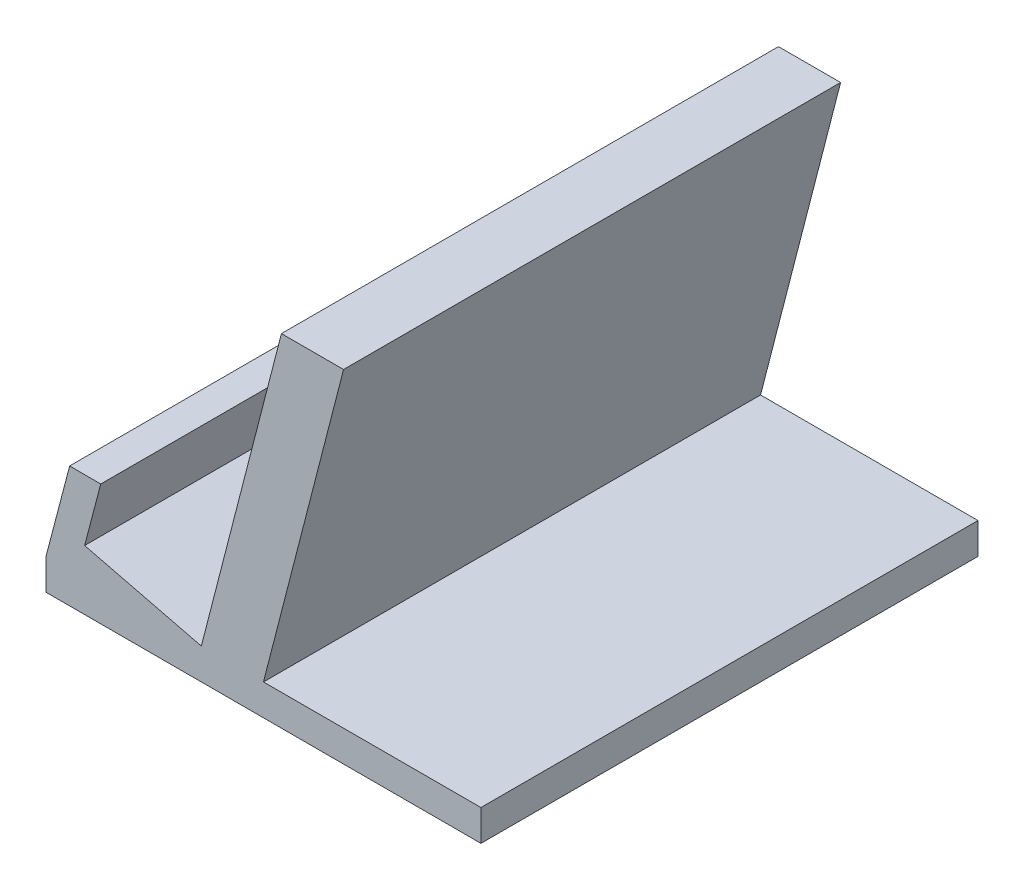
ISO-10303-21;
HEADER;
FILE_DESCRIPTION(('STEP AP214'),'2;1');
FILE_NAME('part.step','',(''),(''),'','','');
FILE_SCHEMA(('AUTOMOTIVE_DESIGN { 1 0 10303 214 1 1 1 1 }'));
ENDSEC;
DATA;
#1=APPLICATION_CONTEXT('core data for automotive mechanical design processes');
#2=APPLICATION_PROTOCOL_DEFINITION('international standard','automotive_design',2000,#1);
#3=PRODUCT_CONTEXT('',#1,'mechanical');
#4=PRODUCT('Part','Part','',(#3));
#5=PRODUCT_RELATED_PRODUCT_CATEGORY('part','',(#4));
#6=PRODUCT_DEFINITION_FORMATION('','',#4);
#7=PRODUCT_DEFINITION_CONTEXT('part definition',#1,'design');
#8=PRODUCT_DEFINITION('design','',#6,#7);
#9=PRODUCT_DEFINITION_SHAPE('','',#8);
#10=(LENGTH_UNIT() NAMED_UNIT(*) SI_UNIT(.MILLI.,.METRE.));
#11=(NAMED_UNIT(*) PLANE_ANGLE_UNIT() SI_UNIT($,.RADIAN.));
#12=(NAMED_UNIT(*) SI_UNIT($,.STERADIAN.) SOLID_ANGLE_UNIT());
#13=UNCERTAINTY_MEASURE_WITH_UNIT(LENGTH_MEASURE(1.E-05),#10,'distance_accuracy_value','');
#14=(GEOMETRIC_REPRESENTATION_CONTEXT(3) GLOBAL_UNCERTAINTY_ASSIGNED_CONTEXT((#13)) GLOBAL_UNIT_ASSIGNED_CONTEXT((#10,
#11,#12)) REPRESENTATION_CONTEXT('',''));
#15=CARTESIAN_POINT('',(0.,0.,0.));
#16=DIRECTION('',(0.,0.,1.));
#17=DIRECTION('',(1.,0.,0.));
#18=AXIS2_PLACEMENT_3D('',#15,#16,#17);
#19=CARTESIAN_POINT('',(-28.0411236469754,7.35367463730965,80.));
#20=DIRECTION('',(0.967291256656847,-0.253668336209348,0.));
#21=DIRECTION('',(0.253668336209348,0.967291256656847,0.));
#22=AXIS2_PLACEMENT_3D('',#19,#20,#21);
#23=PLANE('',#22);
#24=DIRECTION('',(-0.253668336209348,-0.967291256656847,0.));
#25=VECTOR('',#24,1.);
#26=CARTESIAN_POINT('',(-28.0411236469754,7.35367463730965,0.));
#27=LINE('',#26,#25);
#28=CARTESIAN_POINT('',(-26.2396966085866,14.222898639712,0.));
#29=VERTEX_POINT('',#28);
#30=CARTESIAN_POINT('',(-28.8273988234463,4.35544034882152,0.));
#31=VERTEX_POINT('',#30);
#32=EDGE_CURVE('E157',#29,#31,#27,.T.);
#33=ORIENTED_EDGE('',*,*,#32,.F.);
#34=DIRECTION('',(0.,0.,-1.));
#35=VECTOR('',#34,1.);
#36=CARTESIAN_POINT('',(-26.2396966085866,14.222898639712,80.));
#37=LINE('',#36,#35);
#38=CARTESIAN_POINT('',(-26.2396966085866,14.222898639712,80.));
#39=VERTEX_POINT('',#38);
#40=EDGE_CURVE('E11',#39,#29,#37,.T.);
#41=ORIENTED_EDGE('',*,*,#40,.F.);
#42=DIRECTION('',(-0.253668336209348,-0.967291256656847,0.));
#43=VECTOR('',#42,1.);
#44=CARTESIAN_POINT('',(-28.0411236469754,7.35367463730965,80.));
#45=LINE('',#44,#43);
#46=CARTESIAN_POINT('',(-28.8273988234463,4.35544034882152,80.));
#47=VERTEX_POINT('',#46);
#48=EDGE_CURVE('E196',#39,#47,#45,.T.);
#49=ORIENTED_EDGE('',*,*,#48,.T.);
#50=DIRECTION('',(0.,0.,-1.));
#51=VECTOR('',#50,1.);
#52=CARTESIAN_POINT('',(-28.8273988234463,4.35544034882152,80.));
#53=LINE('',#52,#51);
#54=EDGE_CURVE('E101',#47,#31,#53,.T.);
#55=ORIENTED_EDGE('',*,*,#54,.T.);
#56=EDGE_LOOP('',(#33,#41,#49,#55));
#57=FACE_BOUND('',#56,.T.);
#58=ADVANCED_FACE('F41',(#57),#23,.T.);
#59=CARTESIAN_POINT('',(0.0520578395815223,14.1260070032385,80.));
#60=DIRECTION('',(0.00368522301263524,0.999993209542618,0.));
#61=DIRECTION('',(-0.999993209542618,0.00368522301263524,0.));
#62=AXIS2_PLACEMENT_3D('',#59,#60,#61);
#63=PLANE('',#62);
#64=DIRECTION('',(0.999993209542618,-0.00368522301263524,0.));
#65=VECTOR('',#64,1.);
#66=CARTESIAN_POINT('',(0.0520578395815223,14.1260070032385,0.));
#67=LINE('',#66,#65);
#68=CARTESIAN_POINT('',(-31.2396626562997,14.2413247547752,0.));
#69=VERTEX_POINT('',#68);
#70=EDGE_CURVE('E161',#69,#29,#67,.T.);
#71=ORIENTED_EDGE('',*,*,#70,.F.);
#72=DIRECTION('',(0.,0.,-1.));
#73=VECTOR('',#72,1.);
#74=CARTESIAN_POINT('',(-31.2396626562997,14.2413247547752,80.));
#75=LINE('',#74,#73);
#76=CARTESIAN_POINT('',(-31.2396626562997,14.2413247547752,80.));
#77=VERTEX_POINT('',#76);
#78=EDGE_CURVE('E50',#77,#69,#75,.T.);
#79=ORIENTED_EDGE('',*,*,#78,.F.);
#80=DIRECTION('',(0.999993209542618,-0.00368522301263524,0.));
#81=VECTOR('',#80,1.);
#82=CARTESIAN_POINT('',(0.0520578395815223,14.1260070032385,80.));
#83=LINE('',#82,#81);
#84=EDGE_CURVE('E241',#77,#39,#83,.T.);
#85=ORIENTED_EDGE('',*,*,#84,.T.);
#86=ORIENTED_EDGE('',*,*,#40,.T.);
#87=EDGE_LOOP('',(#71,#79,#85,#86));
#88=FACE_BOUND('',#87,.T.);
#89=ADVANCED_FACE('F229',(#88),#63,.T.);
#90=CARTESIAN_POINT('',(-32.723874992757,8.58170780166598,80.));
#91=DIRECTION('',(-0.967291256656847,0.253668336209347,0.));
#92=DIRECTION('',(-0.253668336209347,-0.967291256656847,0.));
#93=AXIS2_PLACEMENT_3D('',#90,#91,#92);
#94=PLANE('',#93);
#95=DIRECTION('',(0.253668336209347,0.967291256656847,0.));
#96=VECTOR('',#95,1.);
#97=CARTESIAN_POINT('',(-32.723874992757,8.58170780166598,0.));
#98=LINE('',#97,#96);
#99=CARTESIAN_POINT('',(-35.0454432360245,-0.270925116584983,0.));
#100=VERTEX_POINT('',#99);
#101=EDGE_CURVE('E165',#100,#69,#98,.T.);
#102=ORIENTED_EDGE('',*,*,#101,.F.);
#103=DIRECTION('',(0.,0.,-1.));
#104=VECTOR('',#103,1.);
#105=CARTESIAN_POINT('',(-35.0454432360245,-0.270925116584983,80.));
#106=LINE('',#105,#104);
#107=CARTESIAN_POINT('',(-35.0454432360245,-0.270925116584983,80.));
#108=VERTEX_POINT('',#107);
#109=EDGE_CURVE('E216',#108,#100,#106,.T.);
#110=ORIENTED_EDGE('',*,*,#109,.F.);
#111=DIRECTION('',(0.253668336209347,0.967291256656847,0.));
#112=VECTOR('',#111,1.);
#113=CARTESIAN_POINT('',(-32.723874992757,8.58170780166598,80.));
#114=LINE('',#113,#112);
#115=EDGE_CURVE('E225',#108,#77,#114,.T.);
#116=ORIENTED_EDGE('',*,*,#115,.T.);
#117=ORIENTED_EDGE('',*,*,#78,.T.);
#118=EDGE_LOOP('',(#102,#110,#116,#117));
#119=FACE_BOUND('',#118,.T.);
#120=ADVANCED_FACE('F223',(#119),#94,.T.);
#121=CARTESIAN_POINT('',(-35.0454432360245,0.,80.));
#122=DIRECTION('',(-1.,0.,0.));
#123=DIRECTION('',(0.,0.,1.));
#124=AXIS2_PLACEMENT_3D('',#121,#122,#123);
#125=PLANE('',#124);
#126=DIRECTION('',(0.,1.,0.));
#127=VECTOR('',#126,1.);
#128=CARTESIAN_POINT('',(-35.0454432360245,0.,0.));
#129=LINE('',#128,#127);
#130=CARTESIAN_POINT('',(-35.0454432360245,-5.27092511658498,0.));
#131=VERTEX_POINT('',#130);
#132=EDGE_CURVE('E169',#131,#100,#129,.T.);
#133=ORIENTED_EDGE('',*,*,#132,.F.);
#134=DIRECTION('',(0.,0.,-1.));
#135=VECTOR('',#134,1.);
#136=CARTESIAN_POINT('',(-35.0454432360245,-5.27092511658498,80.));
#137=LINE('',#136,#135);
#138=CARTESIAN_POINT('',(-35.0454432360245,-5.27092511658498,80.));
#139=VERTEX_POINT('',#138);
#140=EDGE_CURVE('E213',#139,#131,#137,.T.);
#141=ORIENTED_EDGE('',*,*,#140,.F.);
#142=DIRECTION('',(0.,1.,0.));
#143=VECTOR('',#142,1.);
#144=CARTESIAN_POINT('',(-35.0454432360245,0.,80.));
#145=LINE('',#144,#143);
#146=EDGE_CURVE('E240',#139,#108,#145,.T.);
#147=ORIENTED_EDGE('',*,*,#146,.T.);
#148=ORIENTED_EDGE('',*,*,#109,.T.);
#149=EDGE_LOOP('',(#133,#141,#147,#148));
#150=FACE_BOUND('',#149,.T.);
#151=ADVANCED_FACE('F236',(#150),#125,.T.);
#152=CARTESIAN_POINT('',(0.,-5.27092511658498,80.));
#153=DIRECTION('',(0.,1.,0.));
#154=DIRECTION('',(0.,0.,1.));
#155=AXIS2_PLACEMENT_3D('',#152,#153,#154);
#156=PLANE('',#155);
#157=DIRECTION('',(1.,0.,0.));
#158=VECTOR('',#157,1.);
#159=CARTESIAN_POINT('',(0.,-5.27092511658498,0.));
#160=LINE('',#159,#158);
#161=CARTESIAN_POINT('',(34.9545567639755,-5.27092511658498,0.));
#162=VERTEX_POINT('',#161);
#163=EDGE_CURVE('E173',#131,#162,#160,.T.);
#164=ORIENTED_EDGE('',*,*,#163,.T.);
#165=DIRECTION('',(0.,0.,-1.));
#166=VECTOR('',#165,1.);
#167=CARTESIAN_POINT('',(34.9545567639755,-5.27092511658498,80.));
#168=LINE('',#167,#166);
#169=CARTESIAN_POINT('',(34.9545567639755,-5.27092511658498,80.));
#170=VERTEX_POINT('',#169);
#171=EDGE_CURVE('E209',#170,#162,#168,.T.);
#172=ORIENTED_EDGE('',*,*,#171,.F.);
#173=DIRECTION('',(1.,0.,0.));
#174=VECTOR('',#173,1.);
#175=CARTESIAN_POINT('',(0.,-5.27092511658498,80.));
#176=LINE('',#175,#174);
#177=EDGE_CURVE('E246',#139,#170,#176,.T.);
#178=ORIENTED_EDGE('',*,*,#177,.F.);
#179=ORIENTED_EDGE('',*,*,#140,.T.);
#180=EDGE_LOOP('',(#164,#172,#178,#179));
#181=FACE_BOUND('',#180,.T.);
#182=ADVANCED_FACE('F340',(#181),#156,.F.);
#183=CARTESIAN_POINT('',(34.9545567639755,0.,80.));
#184=DIRECTION('',(-1.,0.,0.));
#185=DIRECTION('',(0.,0.,1.));
#186=AXIS2_PLACEMENT_3D('',#183,#184,#185);
#187=PLANE('',#186);
#188=DIRECTION('',(0.,1.,0.));
#189=VECTOR('',#188,1.);
#190=CARTESIAN_POINT('',(34.9545567639755,0.,0.));
#191=LINE('',#190,#189);
#192=CARTESIAN_POINT('',(34.9545567639755,-0.270925116584983,0.));
#193=VERTEX_POINT('',#192);
#194=EDGE_CURVE('E176',#162,#193,#191,.T.);
#195=ORIENTED_EDGE('',*,*,#194,.T.);
#196=DIRECTION('',(0.,0.,-1.));
#197=VECTOR('',#196,1.);
#198=CARTESIAN_POINT('',(34.9545567639755,-0.270925116584983,80.));
#199=LINE('',#198,#197);
#200=CARTESIAN_POINT('',(34.9545567639755,-0.270925116584983,80.));
#201=VERTEX_POINT('',#200);
#202=EDGE_CURVE('E206',#201,#193,#199,.T.);
#203=ORIENTED_EDGE('',*,*,#202,.F.);
#204=DIRECTION('',(0.,1.,0.));
#205=VECTOR('',#204,1.);
#206=CARTESIAN_POINT('',(34.9545567639755,0.,80.));
#207=LINE('',#206,#205);
#208=EDGE_CURVE('E253',#170,#201,#207,.T.);
#209=ORIENTED_EDGE('',*,*,#208,.F.);
#210=ORIENTED_EDGE('',*,*,#171,.T.);
#211=EDGE_LOOP('',(#195,#203,#209,#210));
#212=FACE_BOUND('',#211,.T.);
#213=ADVANCED_FACE('F267',(#212),#187,.F.);
#214=CARTESIAN_POINT('',(0.,-0.270925116584983,80.));
#215=DIRECTION('',(0.,1.,0.));
#216=DIRECTION('',(0.,0.,1.));
#217=AXIS2_PLACEMENT_3D('',#214,#215,#216);
#218=PLANE('',#217);
#219=DIRECTION('',(1.,0.,0.));
#220=VECTOR('',#219,1.);
#221=CARTESIAN_POINT('',(0.,-0.270925116584983,0.));
#222=LINE('',#221,#220);
#223=CARTESIAN_POINT('',(-0.0454432360245064,-0.270925116584983,0.));
#224=VERTEX_POINT('',#223);
#225=EDGE_CURVE('E180',#224,#193,#222,.T.);
#226=ORIENTED_EDGE('',*,*,#225,.F.);
#227=DIRECTION('',(0.,0.,-1.));
#228=VECTOR('',#227,1.);
#229=CARTESIAN_POINT('',(-0.0454432360245064,-0.270925116584983,80.));
#230=LINE('',#229,#228);
#231=CARTESIAN_POINT('',(-0.0454432360245064,-0.270925116584983,80.));
#232=VERTEX_POINT('',#231);
#233=EDGE_CURVE('E203',#232,#224,#230,.T.);
#234=ORIENTED_EDGE('',*,*,#233,.F.);
#235=DIRECTION('',(1.,0.,0.));
#236=VECTOR('',#235,1.);
#237=CARTESIAN_POINT('',(0.,-0.270925116584983,80.));
#238=LINE('',#237,#236);
#239=EDGE_CURVE('E256',#232,#201,#238,.T.);
#240=ORIENTED_EDGE('',*,*,#239,.T.);
#241=ORIENTED_EDGE('',*,*,#202,.T.);
#242=EDGE_LOOP('',(#226,#234,#240,#241));
#243=FACE_BOUND('',#242,.T.);
#244=ADVANCED_FACE('F262',(#243),#218,.T.);
#245=CARTESIAN_POINT('',(0.0228768255995616,-0.00589729070730279,80.));
#246=DIRECTION('',(-0.968342899297644,0.249623775670173,0.));
#247=DIRECTION('',(-0.249623775670173,-0.968342899297644,0.));
#248=AXIS2_PLACEMENT_3D('',#245,#246,#247);
#249=PLANE('',#248);
#250=DIRECTION('',(0.249623775670173,0.968342899297644,0.));
#251=VECTOR('',#250,1.);
#252=CARTESIAN_POINT('',(0.0228768255995616,-0.00589729070730279,0.));
#253=LINE('',#252,#251);
#254=CARTESIAN_POINT('',(12.8437810176582,49.729074883415,0.));
#255=VERTEX_POINT('',#254);
#256=EDGE_CURVE('E184',#224,#255,#253,.T.);
#257=ORIENTED_EDGE('',*,*,#256,.T.);
#258=DIRECTION('',(0.,0.,-1.));
#259=VECTOR('',#258,1.);
#260=CARTESIAN_POINT('',(12.8437810176582,49.729074883415,80.));
#261=LINE('',#260,#259);
#262=CARTESIAN_POINT('',(12.8437810176582,49.729074883415,80.));
#263=VERTEX_POINT('',#262);
#264=EDGE_CURVE('E140',#263,#255,#261,.T.);
#265=ORIENTED_EDGE('',*,*,#264,.F.);
#266=DIRECTION('',(0.249623775670173,0.968342899297644,0.));
#267=VECTOR('',#266,1.);
#268=CARTESIAN_POINT('',(0.0228768255995616,-0.00589729070730279,80.));
#269=LINE('',#268,#267);
#270=EDGE_CURVE('E146',#232,#263,#269,.T.);
#271=ORIENTED_EDGE('',*,*,#270,.F.);
#272=ORIENTED_EDGE('',*,*,#233,.T.);
#273=EDGE_LOOP('',(#257,#265,#271,#272));
#274=FACE_BOUND('',#273,.T.);
#275=ADVANCED_FACE('F270',(#274),#249,.F.);
#276=CARTESIAN_POINT('',(0.,49.729074883415,80.));
#277=DIRECTION('',(0.,1.,0.));
#278=DIRECTION('',(0.,0.,1.));
#279=AXIS2_PLACEMENT_3D('',#276,#277,#278);
#280=PLANE('',#279);
#281=DIRECTION('',(1.,0.,0.));
#282=VECTOR('',#281,1.);
#283=CARTESIAN_POINT('',(0.,49.729074883415,0.));
#284=LINE('',#283,#282);
#285=CARTESIAN_POINT('',(2.84378101765823,49.729074883415,0.));
#286=VERTEX_POINT('',#285);
#287=EDGE_CURVE('E134',#286,#255,#284,.T.);
#288=ORIENTED_EDGE('',*,*,#287,.F.);
#289=DIRECTION('',(0.,0.,-1.));
#290=VECTOR('',#289,1.);
#291=CARTESIAN_POINT('',(2.84378101765823,49.729074883415,80.));
#292=LINE('',#291,#290);
#293=CARTESIAN_POINT('',(2.84378101765823,49.729074883415,80.));
#294=VERTEX_POINT('',#293);
#295=EDGE_CURVE('E129',#294,#286,#292,.T.);
#296=ORIENTED_EDGE('',*,*,#295,.F.);
#297=DIRECTION('',(1.,0.,0.));
#298=VECTOR('',#297,1.);
#299=CARTESIAN_POINT('',(0.,49.729074883415,80.));
#300=LINE('',#299,#298);
#301=EDGE_CURVE('E132',#294,#263,#300,.T.);
#302=ORIENTED_EDGE('',*,*,#301,.T.);
#303=ORIENTED_EDGE('',*,*,#264,.T.);
#304=EDGE_LOOP('',(#288,#296,#302,#303));
#305=FACE_BOUND('',#304,.T.);
#306=ADVANCED_FACE('F131',(#305),#280,.T.);
#307=CARTESIAN_POINT('',(-9.35400288060211,2.4113168159535,80.));
#308=DIRECTION('',(-0.968342899297644,0.249623775670173,0.));
#309=DIRECTION('',(-0.249623775670173,-0.968342899297644,0.));
#310=AXIS2_PLACEMENT_3D('',#307,#308,#309);
#311=PLANE('',#310);
#312=DIRECTION('',(0.249623775670173,0.968342899297644,0.));
#313=VECTOR('',#312,1.);
#314=CARTESIAN_POINT('',(-9.35400288060211,2.4113168159535,0.));
#315=LINE('',#314,#313);
#316=CARTESIAN_POINT('',(-10.0454432360245,-0.270925116584983,0.));
#317=VERTEX_POINT('',#316);
#318=EDGE_CURVE('E190',#317,#286,#315,.T.);
#319=ORIENTED_EDGE('',*,*,#318,.F.);
#320=DIRECTION('',(0.,0.,-1.));
#321=VECTOR('',#320,1.);
#322=CARTESIAN_POINT('',(-10.0454432360245,-0.270925116584983,80.));
#323=LINE('',#322,#321);
#324=CARTESIAN_POINT('',(-10.0454432360245,-0.270925116584983,80.));
#325=VERTEX_POINT('',#324);
#326=EDGE_CURVE('E94',#325,#317,#323,.T.);
#327=ORIENTED_EDGE('',*,*,#326,.F.);
#328=DIRECTION('',(0.249623775670173,0.968342899297644,0.));
#329=VECTOR('',#328,1.);
#330=CARTESIAN_POINT('',(-9.35400288060211,2.4113168159535,80.));
#331=LINE('',#330,#329);
#332=EDGE_CURVE('E143',#325,#294,#331,.T.);
#333=ORIENTED_EDGE('',*,*,#332,.T.);
#334=ORIENTED_EDGE('',*,*,#295,.T.);
#335=EDGE_LOOP('',(#319,#327,#333,#334));
#336=FACE_BOUND('',#335,.T.);
#337=ADVANCED_FACE('F150',(#336),#311,.T.);
#338=CARTESIAN_POINT('',(-0.637543362578506,-2.5882760907115,80.));
#339=DIRECTION('',(-0.239170874536687,-0.97097749344326,0.));
#340=DIRECTION('',(0.97097749344326,-0.239170874536687,0.));
#341=AXIS2_PLACEMENT_3D('',#338,#339,#340);
#342=PLANE('',#341);
#343=DIRECTION('',(-0.97097749344326,0.239170874536687,0.));
#344=VECTOR('',#343,1.);
#345=CARTESIAN_POINT('',(-0.637543362578506,-2.5882760907115,0.));
#346=LINE('',#345,#344);
#347=EDGE_CURVE('E193',#317,#31,#346,.T.);
#348=ORIENTED_EDGE('',*,*,#347,.T.);
#349=ORIENTED_EDGE('',*,*,#54,.F.);
#350=DIRECTION('',(-0.97097749344326,0.239170874536687,0.));
#351=VECTOR('',#350,1.);
#352=CARTESIAN_POINT('',(-0.637543362578506,-2.5882760907115,80.));
#353=LINE('',#352,#351);
#354=EDGE_CURVE('E58',#325,#47,#353,.T.);
#355=ORIENTED_EDGE('',*,*,#354,.F.);
#356=ORIENTED_EDGE('',*,*,#326,.T.);
#357=EDGE_LOOP('',(#348,#349,#355,#356));
#358=FACE_BOUND('',#357,.T.);
#359=ADVANCED_FACE('F283',(#358),#342,.F.);
#360=CARTESIAN_POINT('',(0.,0.,80.));
#361=DIRECTION('',(0.,0.,1.));
#362=DIRECTION('',(1.,0.,0.));
#363=AXIS2_PLACEMENT_3D('',#360,#361,#362);
#364=PLANE('',#363);
#365=ORIENTED_EDGE('',*,*,#48,.F.);
#366=ORIENTED_EDGE('',*,*,#84,.F.);
#367=ORIENTED_EDGE('',*,*,#115,.F.);
#368=ORIENTED_EDGE('',*,*,#146,.F.);
#369=ORIENTED_EDGE('',*,*,#177,.T.);
#370=ORIENTED_EDGE('',*,*,#208,.T.);
#371=ORIENTED_EDGE('',*,*,#239,.F.);
#372=ORIENTED_EDGE('',*,*,#270,.T.);
#373=ORIENTED_EDGE('',*,*,#301,.F.);
#374=ORIENTED_EDGE('',*,*,#332,.F.);
#375=ORIENTED_EDGE('',*,*,#354,.T.);
#376=EDGE_LOOP('',(#365,#366,#367,#368,#369,#370,#371,#372,#373,#374,#375));
#377=FACE_BOUND('',#376,.T.);
#378=ADVANCED_FACE('F142',(#377),#364,.T.);
#379=CARTESIAN_POINT('',(0.,0.,0.));
#380=DIRECTION('',(0.,0.,1.));
#381=DIRECTION('',(1.,0.,0.));
#382=AXIS2_PLACEMENT_3D('',#379,#380,#381);
#383=PLANE('',#382);
#384=ORIENTED_EDGE('',*,*,#32,.T.);
#385=ORIENTED_EDGE('',*,*,#347,.F.);
#386=ORIENTED_EDGE('',*,*,#318,.T.);
#387=ORIENTED_EDGE('',*,*,#287,.T.);
#388=ORIENTED_EDGE('',*,*,#256,.F.);
#389=ORIENTED_EDGE('',*,*,#225,.T.);
#390=ORIENTED_EDGE('',*,*,#194,.F.);
#391=ORIENTED_EDGE('',*,*,#163,.F.);
#392=ORIENTED_EDGE('',*,*,#132,.T.);
#393=ORIENTED_EDGE('',*,*,#101,.T.);
#394=ORIENTED_EDGE('',*,*,#70,.T.);
#395=EDGE_LOOP('',(#384,#385,#386,#387,#388,#389,#390,#391,#392,#393,#394));
#396=FACE_BOUND('',#395,.T.);
#397=ADVANCED_FACE('F231',(#396),#383,.F.);
#398=CLOSED_SHELL('',(#58,#89,#120,#151,#182,#213,#244,#275,#306,#337,#359,#378,#397));
#399=MANIFOLD_SOLID_BREP('B2',#398);
#400=ADVANCED_BREP_SHAPE_REPRESENTATION('',(#18,#399),#14);
#401=SHAPE_DEFINITION_REPRESENTATION(#9,#400);
ENDSEC;
END-ISO-10303-21;
